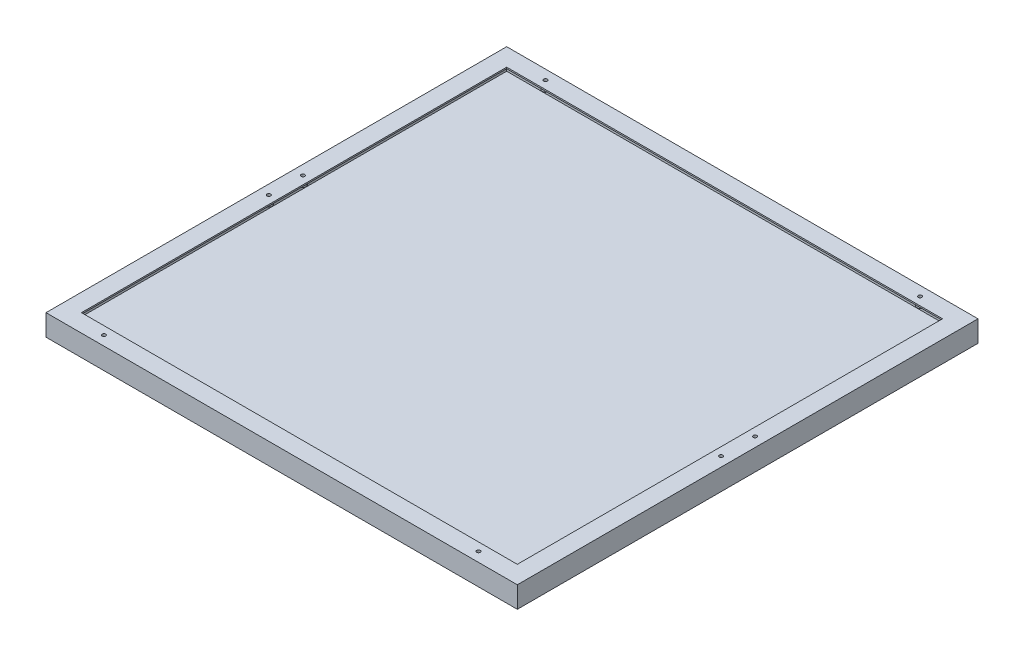
ISO-10303-21;
HEADER;
FILE_DESCRIPTION(('STEP AP214'),'2;1');
FILE_NAME('part.step','',(''),(''),'','','');
FILE_SCHEMA(('AUTOMOTIVE_DESIGN { 1 0 10303 214 1 1 1 1 }'));
ENDSEC;
DATA;
#1=APPLICATION_CONTEXT('core data for automotive mechanical design processes');
#2=APPLICATION_PROTOCOL_DEFINITION('international standard','automotive_design',2000,#1);
#3=PRODUCT_CONTEXT('',#1,'mechanical');
#4=PRODUCT('Part','Part','',(#3));
#5=PRODUCT_RELATED_PRODUCT_CATEGORY('part','',(#4));
#6=PRODUCT_DEFINITION_FORMATION('','',#4);
#7=PRODUCT_DEFINITION_CONTEXT('part definition',#1,'design');
#8=PRODUCT_DEFINITION('design','',#6,#7);
#9=PRODUCT_DEFINITION_SHAPE('','',#8);
#10=(LENGTH_UNIT() NAMED_UNIT(*) SI_UNIT(.MILLI.,.METRE.));
#11=(NAMED_UNIT(*) PLANE_ANGLE_UNIT() SI_UNIT($,.RADIAN.));
#12=(NAMED_UNIT(*) SI_UNIT($,.STERADIAN.) SOLID_ANGLE_UNIT());
#13=UNCERTAINTY_MEASURE_WITH_UNIT(LENGTH_MEASURE(1.E-05),#10,'distance_accuracy_value','');
#14=(GEOMETRIC_REPRESENTATION_CONTEXT(3) GLOBAL_UNCERTAINTY_ASSIGNED_CONTEXT((#13)) GLOBAL_UNIT_ASSIGNED_CONTEXT((#10,
#11,#12)) REPRESENTATION_CONTEXT('',''));
#15=CARTESIAN_POINT('',(0.,0.,0.));
#16=DIRECTION('',(0.,0.,1.));
#17=DIRECTION('',(1.,0.,0.));
#18=AXIS2_PLACEMENT_3D('',#15,#16,#17);
#19=CARTESIAN_POINT('',(25.,-20.,-625.));
#20=DIRECTION('',(-1.,0.,0.));
#21=DIRECTION('',(0.,0.,1.));
#22=AXIS2_PLACEMENT_3D('',#19,#20,#21);
#23=PLANE('',#22);
#24=DIRECTION('',(0.,0.,1.));
#25=VECTOR('',#24,1.);
#26=CARTESIAN_POINT('',(25.,-2.,-625.));
#27=LINE('',#26,#25);
#28=CARTESIAN_POINT('',(25.,-2.,-625.));
#29=VERTEX_POINT('',#28);
#30=CARTESIAN_POINT('',(25.0000000000001,-2.,-25.));
#31=VERTEX_POINT('',#30);
#32=EDGE_CURVE('E54',#29,#31,#27,.T.);
#33=ORIENTED_EDGE('',*,*,#32,.F.);
#34=DIRECTION('',(0.,1.,0.));
#35=VECTOR('',#34,1.);
#36=CARTESIAN_POINT('',(25.,-20.,-625.));
#37=LINE('',#36,#35);
#38=CARTESIAN_POINT('',(25.,0.,-625.));
#39=VERTEX_POINT('',#38);
#40=EDGE_CURVE('E234',#29,#39,#37,.T.);
#41=ORIENTED_EDGE('',*,*,#40,.T.);
#42=DIRECTION('',(0.,0.,1.));
#43=VECTOR('',#42,1.);
#44=CARTESIAN_POINT('',(25.,0.,-625.));
#45=LINE('',#44,#43);
#46=CARTESIAN_POINT('',(25.0000000000001,0.,-25.));
#47=VERTEX_POINT('',#46);
#48=EDGE_CURVE('E138',#39,#47,#45,.T.);
#49=ORIENTED_EDGE('',*,*,#48,.T.);
#50=DIRECTION('',(0.,1.,0.));
#51=VECTOR('',#50,1.);
#52=CARTESIAN_POINT('',(25.0000000000001,-20.,-25.));
#53=LINE('',#52,#51);
#54=EDGE_CURVE('E61',#31,#47,#53,.T.);
#55=ORIENTED_EDGE('',*,*,#54,.F.);
#56=EDGE_LOOP('',(#33,#41,#49,#55));
#57=FACE_BOUND('',#56,.T.);
#58=ADVANCED_FACE('F37',(#57),#23,.F.);
#59=CARTESIAN_POINT('',(25.,-20.,-625.));
#60=DIRECTION('',(0.,0.,-1.));
#61=DIRECTION('',(-1.,0.,0.));
#62=AXIS2_PLACEMENT_3D('',#59,#60,#61);
#63=PLANE('',#62);
#64=DIRECTION('',(-1.,0.,0.));
#65=VECTOR('',#64,1.);
#66=CARTESIAN_POINT('',(25.,-2.,-625.));
#67=LINE('',#66,#65);
#68=CARTESIAN_POINT('',(640.,-2.,-625.));
#69=VERTEX_POINT('',#68);
#70=EDGE_CURVE('E174',#69,#29,#67,.T.);
#71=ORIENTED_EDGE('',*,*,#70,.F.);
#72=DIRECTION('',(0.,1.,0.));
#73=VECTOR('',#72,1.);
#74=CARTESIAN_POINT('',(640.,-20.,-625.));
#75=LINE('',#74,#73);
#76=CARTESIAN_POINT('',(640.,0.,-625.));
#77=VERTEX_POINT('',#76);
#78=EDGE_CURVE('E237',#69,#77,#75,.T.);
#79=ORIENTED_EDGE('',*,*,#78,.T.);
#80=DIRECTION('',(-1.,0.,0.));
#81=VECTOR('',#80,1.);
#82=CARTESIAN_POINT('',(25.,0.,-625.));
#83=LINE('',#82,#81);
#84=EDGE_CURVE('E231',#77,#39,#83,.T.);
#85=ORIENTED_EDGE('',*,*,#84,.T.);
#86=ORIENTED_EDGE('',*,*,#40,.F.);
#87=EDGE_LOOP('',(#71,#79,#85,#86));
#88=FACE_BOUND('',#87,.T.);
#89=ADVANCED_FACE('F341',(#88),#63,.F.);
#90=CARTESIAN_POINT('',(640.,-20.,-625.));
#91=DIRECTION('',(1.,0.,0.));
#92=DIRECTION('',(0.,0.,-1.));
#93=AXIS2_PLACEMENT_3D('',#90,#91,#92);
#94=PLANE('',#93);
#95=DIRECTION('',(0.,0.,-1.));
#96=VECTOR('',#95,1.);
#97=CARTESIAN_POINT('',(640.,-2.,-625.));
#98=LINE('',#97,#96);
#99=CARTESIAN_POINT('',(640.,-2.,-25.));
#100=VERTEX_POINT('',#99);
#101=EDGE_CURVE('E221',#100,#69,#98,.T.);
#102=ORIENTED_EDGE('',*,*,#101,.F.);
#103=DIRECTION('',(0.,1.,0.));
#104=VECTOR('',#103,1.);
#105=CARTESIAN_POINT('',(640.,-20.,-25.));
#106=LINE('',#105,#104);
#107=CARTESIAN_POINT('',(640.,0.,-25.));
#108=VERTEX_POINT('',#107);
#109=EDGE_CURVE('E239',#100,#108,#106,.T.);
#110=ORIENTED_EDGE('',*,*,#109,.T.);
#111=DIRECTION('',(0.,0.,-1.));
#112=VECTOR('',#111,1.);
#113=CARTESIAN_POINT('',(640.,0.,-625.));
#114=LINE('',#113,#112);
#115=EDGE_CURVE('E228',#108,#77,#114,.T.);
#116=ORIENTED_EDGE('',*,*,#115,.T.);
#117=ORIENTED_EDGE('',*,*,#78,.F.);
#118=EDGE_LOOP('',(#102,#110,#116,#117));
#119=FACE_BOUND('',#118,.T.);
#120=ADVANCED_FACE('F347',(#119),#94,.F.);
#121=CARTESIAN_POINT('',(25.0000000000001,-20.,-25.));
#122=DIRECTION('',(0.,0.,1.));
#123=DIRECTION('',(1.,0.,0.));
#124=AXIS2_PLACEMENT_3D('',#121,#122,#123);
#125=PLANE('',#124);
#126=DIRECTION('',(1.,0.,0.));
#127=VECTOR('',#126,1.);
#128=CARTESIAN_POINT('',(25.0000000000001,-2.,-25.));
#129=LINE('',#128,#127);
#130=EDGE_CURVE('E219',#31,#100,#129,.T.);
#131=ORIENTED_EDGE('',*,*,#130,.F.);
#132=ORIENTED_EDGE('',*,*,#54,.T.);
#133=DIRECTION('',(1.,0.,0.));
#134=VECTOR('',#133,1.);
#135=CARTESIAN_POINT('',(25.0000000000001,0.,-25.));
#136=LINE('',#135,#134);
#137=EDGE_CURVE('E226',#47,#108,#136,.T.);
#138=ORIENTED_EDGE('',*,*,#137,.T.);
#139=ORIENTED_EDGE('',*,*,#109,.F.);
#140=EDGE_LOOP('',(#131,#132,#138,#139));
#141=FACE_BOUND('',#140,.T.);
#142=ADVANCED_FACE('F352',(#141),#125,.F.);
#143=CARTESIAN_POINT('',(0.,-30.,0.));
#144=DIRECTION('',(-1.,0.,0.));
#145=DIRECTION('',(0.,0.,1.));
#146=AXIS2_PLACEMENT_3D('',#143,#144,#145);
#147=PLANE('',#146);
#148=DIRECTION('',(0.,0.,1.));
#149=VECTOR('',#148,1.);
#150=CARTESIAN_POINT('',(0.,0.,0.));
#151=LINE('',#150,#149);
#152=CARTESIAN_POINT('',(0.,0.,-650.));
#153=VERTEX_POINT('',#152);
#154=CARTESIAN_POINT('',(0.,0.,0.));
#155=VERTEX_POINT('',#154);
#156=EDGE_CURVE('E289',#153,#155,#151,.T.);
#157=ORIENTED_EDGE('',*,*,#156,.F.);
#158=DIRECTION('',(0.,1.,0.));
#159=VECTOR('',#158,1.);
#160=CARTESIAN_POINT('',(0.,-30.,-650.));
#161=LINE('',#160,#159);
#162=CARTESIAN_POINT('',(0.,-30.,-650.));
#163=VERTEX_POINT('',#162);
#164=EDGE_CURVE('E11',#163,#153,#161,.T.);
#165=ORIENTED_EDGE('',*,*,#164,.F.);
#166=DIRECTION('',(0.,0.,1.));
#167=VECTOR('',#166,1.);
#168=CARTESIAN_POINT('',(0.,-30.,0.));
#169=LINE('',#168,#167);
#170=CARTESIAN_POINT('',(0.,-30.,0.));
#171=VERTEX_POINT('',#170);
#172=EDGE_CURVE('E290',#163,#171,#169,.T.);
#173=ORIENTED_EDGE('',*,*,#172,.T.);
#174=DIRECTION('',(0.,1.,0.));
#175=VECTOR('',#174,1.);
#176=CARTESIAN_POINT('',(0.,-30.,0.));
#177=LINE('',#176,#175);
#178=EDGE_CURVE('E41',#171,#155,#177,.T.);
#179=ORIENTED_EDGE('',*,*,#178,.T.);
#180=EDGE_LOOP('',(#157,#165,#173,#179));
#181=FACE_BOUND('',#180,.T.);
#182=ADVANCED_FACE('F39',(#181),#147,.T.);
#183=CARTESIAN_POINT('',(0.,-30.,-650.));
#184=DIRECTION('',(0.,0.,-1.));
#185=DIRECTION('',(-1.,0.,0.));
#186=AXIS2_PLACEMENT_3D('',#183,#184,#185);
#187=PLANE('',#186);
#188=DIRECTION('',(-1.,0.,0.));
#189=VECTOR('',#188,1.);
#190=CARTESIAN_POINT('',(0.,0.,-650.));
#191=LINE('',#190,#189);
#192=CARTESIAN_POINT('',(665.,0.,-650.));
#193=VERTEX_POINT('',#192);
#194=EDGE_CURVE('E294',#193,#153,#191,.T.);
#195=ORIENTED_EDGE('',*,*,#194,.F.);
#196=DIRECTION('',(0.,1.,0.));
#197=VECTOR('',#196,1.);
#198=CARTESIAN_POINT('',(665.,-30.,-650.));
#199=LINE('',#198,#197);
#200=CARTESIAN_POINT('',(665.,-30.,-650.));
#201=VERTEX_POINT('',#200);
#202=EDGE_CURVE('E46',#201,#193,#199,.T.);
#203=ORIENTED_EDGE('',*,*,#202,.F.);
#204=DIRECTION('',(-1.,0.,0.));
#205=VECTOR('',#204,1.);
#206=CARTESIAN_POINT('',(0.,-30.,-650.));
#207=LINE('',#206,#205);
#208=EDGE_CURVE('E300',#201,#163,#207,.T.);
#209=ORIENTED_EDGE('',*,*,#208,.T.);
#210=ORIENTED_EDGE('',*,*,#164,.T.);
#211=EDGE_LOOP('',(#195,#203,#209,#210));
#212=FACE_BOUND('',#211,.T.);
#213=ADVANCED_FACE('F326',(#212),#187,.T.);
#214=CARTESIAN_POINT('',(665.,-30.,0.));
#215=DIRECTION('',(1.,0.,0.));
#216=DIRECTION('',(0.,0.,-1.));
#217=AXIS2_PLACEMENT_3D('',#214,#215,#216);
#218=PLANE('',#217);
#219=DIRECTION('',(0.,0.,-1.));
#220=VECTOR('',#219,1.);
#221=CARTESIAN_POINT('',(665.,0.,0.));
#222=LINE('',#221,#220);
#223=CARTESIAN_POINT('',(665.,0.,0.));
#224=VERTEX_POINT('',#223);
#225=EDGE_CURVE('E308',#224,#193,#222,.T.);
#226=ORIENTED_EDGE('',*,*,#225,.F.);
#227=DIRECTION('',(0.,1.,0.));
#228=VECTOR('',#227,1.);
#229=CARTESIAN_POINT('',(665.,-30.,0.));
#230=LINE('',#229,#228);
#231=CARTESIAN_POINT('',(665.,-30.,0.));
#232=VERTEX_POINT('',#231);
#233=EDGE_CURVE('E313',#232,#224,#230,.T.);
#234=ORIENTED_EDGE('',*,*,#233,.F.);
#235=DIRECTION('',(0.,0.,-1.));
#236=VECTOR('',#235,1.);
#237=CARTESIAN_POINT('',(665.,-30.,0.));
#238=LINE('',#237,#236);
#239=EDGE_CURVE('E297',#232,#201,#238,.T.);
#240=ORIENTED_EDGE('',*,*,#239,.T.);
#241=ORIENTED_EDGE('',*,*,#202,.T.);
#242=EDGE_LOOP('',(#226,#234,#240,#241));
#243=FACE_BOUND('',#242,.T.);
#244=ADVANCED_FACE('F332',(#243),#218,.T.);
#245=CARTESIAN_POINT('',(0.,-30.,0.));
#246=DIRECTION('',(0.,0.,1.));
#247=DIRECTION('',(1.,0.,0.));
#248=AXIS2_PLACEMENT_3D('',#245,#246,#247);
#249=PLANE('',#248);
#250=DIRECTION('',(1.,0.,0.));
#251=VECTOR('',#250,1.);
#252=CARTESIAN_POINT('',(0.,0.,0.));
#253=LINE('',#252,#251);
#254=EDGE_CURVE('E305',#155,#224,#253,.T.);
#255=ORIENTED_EDGE('',*,*,#254,.F.);
#256=ORIENTED_EDGE('',*,*,#178,.F.);
#257=DIRECTION('',(1.,0.,0.));
#258=VECTOR('',#257,1.);
#259=CARTESIAN_POINT('',(0.,-30.,0.));
#260=LINE('',#259,#258);
#261=EDGE_CURVE('E293',#171,#232,#260,.T.);
#262=ORIENTED_EDGE('',*,*,#261,.T.);
#263=ORIENTED_EDGE('',*,*,#233,.T.);
#264=EDGE_LOOP('',(#255,#256,#262,#263));
#265=FACE_BOUND('',#264,.T.);
#266=ADVANCED_FACE('F321',(#265),#249,.T.);
#267=CARTESIAN_POINT('',(0.,-30.,0.));
#268=DIRECTION('',(0.,-1.,0.));
#269=DIRECTION('',(0.,0.,-1.));
#270=AXIS2_PLACEMENT_3D('',#267,#268,#269);
#271=PLANE('',#270);
#272=ORIENTED_EDGE('',*,*,#172,.F.);
#273=ORIENTED_EDGE('',*,*,#208,.F.);
#274=ORIENTED_EDGE('',*,*,#239,.F.);
#275=ORIENTED_EDGE('',*,*,#261,.F.);
#276=EDGE_LOOP('',(#272,#273,#274,#275));
#277=FACE_BOUND('',#276,.T.);
#278=ADVANCED_FACE('F329',(#277),#271,.T.);
#279=CARTESIAN_POINT('',(0.,0.,0.));
#280=DIRECTION('',(0.,-1.,0.));
#281=DIRECTION('',(0.,0.,-1.));
#282=AXIS2_PLACEMENT_3D('',#279,#280,#281);
#283=PLANE('',#282);
#284=ORIENTED_EDGE('',*,*,#137,.F.);
#285=ORIENTED_EDGE('',*,*,#48,.F.);
#286=ORIENTED_EDGE('',*,*,#84,.F.);
#287=ORIENTED_EDGE('',*,*,#115,.F.);
#288=EDGE_LOOP('',(#284,#285,#286,#287));
#289=FACE_BOUND('',#288,.T.);
#290=CARTESIAN_POINT('',(68.25,0.,-13.5));
#291=DIRECTION('',(0.,1.,0.));
#292=DIRECTION('',(0.,0.,1.));
#293=AXIS2_PLACEMENT_3D('',#290,#291,#292);
#294=CIRCLE('',#293,2.5273);
#295=CARTESIAN_POINT('',(68.25,0.,-10.9727));
#296=VERTEX_POINT('',#295);
#297=EDGE_CURVE('E236',#296,#296,#294,.T.);
#298=ORIENTED_EDGE('',*,*,#297,.F.);
#299=EDGE_LOOP('',(#298));
#300=FACE_BOUND('',#299,.T.);
#301=CARTESIAN_POINT('',(13.5,0.,-301.));
#302=DIRECTION('',(0.,1.,0.));
#303=DIRECTION('',(0.,0.,1.));
#304=AXIS2_PLACEMENT_3D('',#301,#302,#303);
#305=CIRCLE('',#304,2.5273);
#306=CARTESIAN_POINT('',(13.5,0.,-298.4727));
#307=VERTEX_POINT('',#306);
#308=EDGE_CURVE('E247',#307,#307,#305,.T.);
#309=ORIENTED_EDGE('',*,*,#308,.F.);
#310=EDGE_LOOP('',(#309));
#311=FACE_BOUND('',#310,.T.);
#312=CARTESIAN_POINT('',(596.75,0.,-13.5));
#313=DIRECTION('',(0.,1.,0.));
#314=DIRECTION('',(0.,0.,1.));
#315=AXIS2_PLACEMENT_3D('',#312,#313,#314);
#316=CIRCLE('',#315,2.52730000000001);
#317=CARTESIAN_POINT('',(596.75,0.,-10.9726999999999));
#318=VERTEX_POINT('',#317);
#319=EDGE_CURVE('E253',#318,#318,#316,.T.);
#320=ORIENTED_EDGE('',*,*,#319,.F.);
#321=EDGE_LOOP('',(#320));
#322=FACE_BOUND('',#321,.T.);
#323=CARTESIAN_POINT('',(651.5,0.,-301.));
#324=DIRECTION('',(0.,1.,0.));
#325=DIRECTION('',(0.,0.,1.));
#326=AXIS2_PLACEMENT_3D('',#323,#324,#325);
#327=CIRCLE('',#326,2.52730000000001);
#328=CARTESIAN_POINT('',(651.5,0.,-298.4727));
#329=VERTEX_POINT('',#328);
#330=EDGE_CURVE('E259',#329,#329,#327,.T.);
#331=ORIENTED_EDGE('',*,*,#330,.F.);
#332=EDGE_LOOP('',(#331));
#333=FACE_BOUND('',#332,.T.);
#334=CARTESIAN_POINT('',(651.5,0.,-349.));
#335=DIRECTION('',(0.,1.,0.));
#336=DIRECTION('',(0.,0.,1.));
#337=AXIS2_PLACEMENT_3D('',#334,#335,#336);
#338=CIRCLE('',#337,2.52730000000001);
#339=CARTESIAN_POINT('',(651.5,0.,-346.4727));
#340=VERTEX_POINT('',#339);
#341=EDGE_CURVE('E265',#340,#340,#338,.T.);
#342=ORIENTED_EDGE('',*,*,#341,.F.);
#343=EDGE_LOOP('',(#342));
#344=FACE_BOUND('',#343,.T.);
#345=CARTESIAN_POINT('',(596.75,0.,-636.5));
#346=DIRECTION('',(0.,1.,0.));
#347=DIRECTION('',(0.,0.,1.));
#348=AXIS2_PLACEMENT_3D('',#345,#346,#347);
#349=CIRCLE('',#348,2.52730000000001);
#350=CARTESIAN_POINT('',(596.75,0.,-633.9727));
#351=VERTEX_POINT('',#350);
#352=EDGE_CURVE('E271',#351,#351,#349,.T.);
#353=ORIENTED_EDGE('',*,*,#352,.F.);
#354=EDGE_LOOP('',(#353));
#355=FACE_BOUND('',#354,.T.);
#356=CARTESIAN_POINT('',(68.25,0.,-636.5));
#357=DIRECTION('',(0.,1.,0.));
#358=DIRECTION('',(0.,0.,1.));
#359=AXIS2_PLACEMENT_3D('',#356,#357,#358);
#360=CIRCLE('',#359,2.5273);
#361=CARTESIAN_POINT('',(68.25,0.,-633.9727));
#362=VERTEX_POINT('',#361);
#363=EDGE_CURVE('E277',#362,#362,#360,.T.);
#364=ORIENTED_EDGE('',*,*,#363,.F.);
#365=EDGE_LOOP('',(#364));
#366=FACE_BOUND('',#365,.T.);
#367=CARTESIAN_POINT('',(13.5000000000001,0.,-349.));
#368=DIRECTION('',(0.,1.,0.));
#369=DIRECTION('',(0.,0.,1.));
#370=AXIS2_PLACEMENT_3D('',#367,#368,#369);
#371=CIRCLE('',#370,2.5273);
#372=CARTESIAN_POINT('',(13.5000000000001,0.,-346.4727));
#373=VERTEX_POINT('',#372);
#374=EDGE_CURVE('E283',#373,#373,#371,.T.);
#375=ORIENTED_EDGE('',*,*,#374,.F.);
#376=EDGE_LOOP('',(#375));
#377=FACE_BOUND('',#376,.T.);
#378=ORIENTED_EDGE('',*,*,#156,.T.);
#379=ORIENTED_EDGE('',*,*,#254,.T.);
#380=ORIENTED_EDGE('',*,*,#225,.T.);
#381=ORIENTED_EDGE('',*,*,#194,.T.);
#382=EDGE_LOOP('',(#378,#379,#380,#381));
#383=FACE_BOUND('',#382,.T.);
#384=ADVANCED_FACE('F323',(#289,#300,#311,#322,#333,#344,#355,#366,#377,#383),#283,.F.);
#385=CARTESIAN_POINT('',(13.5000000000001,-9.65,-349.));
#386=DIRECTION('',(0.,-1.,0.));
#387=DIRECTION('',(0.,0.,-1.));
#388=AXIS2_PLACEMENT_3D('',#385,#386,#387);
#389=PLANE('',#388);
#390=CARTESIAN_POINT('',(13.5000000000001,-9.65,-349.));
#391=DIRECTION('',(0.,1.,0.));
#392=DIRECTION('',(0.,0.,1.));
#393=AXIS2_PLACEMENT_3D('',#390,#391,#392);
#394=CIRCLE('',#393,2.5273);
#395=CARTESIAN_POINT('',(13.5000000000001,-9.65,-346.4727));
#396=VERTEX_POINT('',#395);
#397=EDGE_CURVE('E286',#396,#396,#394,.T.);
#398=ORIENTED_EDGE('',*,*,#397,.T.);
#399=EDGE_LOOP('',(#398));
#400=FACE_BOUND('',#399,.T.);
#401=ADVANCED_FACE('F413',(#400),#389,.F.);
#402=CARTESIAN_POINT('',(13.5000000000001,0.,-349.));
#403=DIRECTION('',(0.,1.,0.));
#404=DIRECTION('',(0.,0.,1.));
#405=AXIS2_PLACEMENT_3D('',#402,#403,#404);
#406=CYLINDRICAL_SURFACE('',#405,2.5273);
#407=ORIENTED_EDGE('',*,*,#397,.F.);
#408=EDGE_LOOP('',(#407));
#409=FACE_BOUND('',#408,.T.);
#410=ORIENTED_EDGE('',*,*,#374,.T.);
#411=EDGE_LOOP('',(#410));
#412=FACE_BOUND('',#411,.T.);
#413=ADVANCED_FACE('F409',(#409,#412),#406,.F.);
#414=CARTESIAN_POINT('',(68.25,-9.65,-636.5));
#415=DIRECTION('',(0.,-1.,0.));
#416=DIRECTION('',(0.,0.,-1.));
#417=AXIS2_PLACEMENT_3D('',#414,#415,#416);
#418=PLANE('',#417);
#419=CARTESIAN_POINT('',(68.25,-9.65,-636.5));
#420=DIRECTION('',(0.,1.,0.));
#421=DIRECTION('',(0.,0.,1.));
#422=AXIS2_PLACEMENT_3D('',#419,#420,#421);
#423=CIRCLE('',#422,2.5273);
#424=CARTESIAN_POINT('',(68.25,-9.65,-633.9727));
#425=VERTEX_POINT('',#424);
#426=EDGE_CURVE('E280',#425,#425,#423,.T.);
#427=ORIENTED_EDGE('',*,*,#426,.T.);
#428=EDGE_LOOP('',(#427));
#429=FACE_BOUND('',#428,.T.);
#430=ADVANCED_FACE('F405',(#429),#418,.F.);
#431=CARTESIAN_POINT('',(68.25,0.,-636.5));
#432=DIRECTION('',(0.,1.,0.));
#433=DIRECTION('',(0.,0.,1.));
#434=AXIS2_PLACEMENT_3D('',#431,#432,#433);
#435=CYLINDRICAL_SURFACE('',#434,2.5273);
#436=ORIENTED_EDGE('',*,*,#426,.F.);
#437=EDGE_LOOP('',(#436));
#438=FACE_BOUND('',#437,.T.);
#439=ORIENTED_EDGE('',*,*,#363,.T.);
#440=EDGE_LOOP('',(#439));
#441=FACE_BOUND('',#440,.T.);
#442=ADVANCED_FACE('F401',(#438,#441),#435,.F.);
#443=CARTESIAN_POINT('',(596.75,-9.65,-636.5));
#444=DIRECTION('',(0.,-1.,0.));
#445=DIRECTION('',(0.,0.,-1.));
#446=AXIS2_PLACEMENT_3D('',#443,#444,#445);
#447=PLANE('',#446);
#448=CARTESIAN_POINT('',(596.75,-9.65,-636.5));
#449=DIRECTION('',(0.,1.,0.));
#450=DIRECTION('',(0.,0.,1.));
#451=AXIS2_PLACEMENT_3D('',#448,#449,#450);
#452=CIRCLE('',#451,2.52730000000001);
#453=CARTESIAN_POINT('',(596.75,-9.65,-633.9727));
#454=VERTEX_POINT('',#453);
#455=EDGE_CURVE('E274',#454,#454,#452,.T.);
#456=ORIENTED_EDGE('',*,*,#455,.T.);
#457=EDGE_LOOP('',(#456));
#458=FACE_BOUND('',#457,.T.);
#459=ADVANCED_FACE('F397',(#458),#447,.F.);
#460=CARTESIAN_POINT('',(596.75,0.,-636.5));
#461=DIRECTION('',(0.,1.,0.));
#462=DIRECTION('',(0.,0.,1.));
#463=AXIS2_PLACEMENT_3D('',#460,#461,#462);
#464=CYLINDRICAL_SURFACE('',#463,2.52730000000001);
#465=ORIENTED_EDGE('',*,*,#455,.F.);
#466=EDGE_LOOP('',(#465));
#467=FACE_BOUND('',#466,.T.);
#468=ORIENTED_EDGE('',*,*,#352,.T.);
#469=EDGE_LOOP('',(#468));
#470=FACE_BOUND('',#469,.T.);
#471=ADVANCED_FACE('F393',(#467,#470),#464,.F.);
#472=CARTESIAN_POINT('',(651.5,-9.65,-349.));
#473=DIRECTION('',(0.,-1.,0.));
#474=DIRECTION('',(0.,0.,-1.));
#475=AXIS2_PLACEMENT_3D('',#472,#473,#474);
#476=PLANE('',#475);
#477=CARTESIAN_POINT('',(651.5,-9.65,-349.));
#478=DIRECTION('',(0.,1.,0.));
#479=DIRECTION('',(0.,0.,1.));
#480=AXIS2_PLACEMENT_3D('',#477,#478,#479);
#481=CIRCLE('',#480,2.52730000000001);
#482=CARTESIAN_POINT('',(651.5,-9.65,-346.4727));
#483=VERTEX_POINT('',#482);
#484=EDGE_CURVE('E268',#483,#483,#481,.T.);
#485=ORIENTED_EDGE('',*,*,#484,.T.);
#486=EDGE_LOOP('',(#485));
#487=FACE_BOUND('',#486,.T.);
#488=ADVANCED_FACE('F389',(#487),#476,.F.);
#489=CARTESIAN_POINT('',(651.5,0.,-349.));
#490=DIRECTION('',(0.,1.,0.));
#491=DIRECTION('',(0.,0.,1.));
#492=AXIS2_PLACEMENT_3D('',#489,#490,#491);
#493=CYLINDRICAL_SURFACE('',#492,2.52730000000001);
#494=ORIENTED_EDGE('',*,*,#484,.F.);
#495=EDGE_LOOP('',(#494));
#496=FACE_BOUND('',#495,.T.);
#497=ORIENTED_EDGE('',*,*,#341,.T.);
#498=EDGE_LOOP('',(#497));
#499=FACE_BOUND('',#498,.T.);
#500=ADVANCED_FACE('F385',(#496,#499),#493,.F.);
#501=CARTESIAN_POINT('',(651.5,-9.65,-301.));
#502=DIRECTION('',(0.,-1.,0.));
#503=DIRECTION('',(0.,0.,-1.));
#504=AXIS2_PLACEMENT_3D('',#501,#502,#503);
#505=PLANE('',#504);
#506=CARTESIAN_POINT('',(651.5,-9.65,-301.));
#507=DIRECTION('',(0.,1.,0.));
#508=DIRECTION('',(0.,0.,1.));
#509=AXIS2_PLACEMENT_3D('',#506,#507,#508);
#510=CIRCLE('',#509,2.52730000000001);
#511=CARTESIAN_POINT('',(651.5,-9.65,-298.4727));
#512=VERTEX_POINT('',#511);
#513=EDGE_CURVE('E262',#512,#512,#510,.T.);
#514=ORIENTED_EDGE('',*,*,#513,.T.);
#515=EDGE_LOOP('',(#514));
#516=FACE_BOUND('',#515,.T.);
#517=ADVANCED_FACE('F381',(#516),#505,.F.);
#518=CARTESIAN_POINT('',(651.5,0.,-301.));
#519=DIRECTION('',(0.,1.,0.));
#520=DIRECTION('',(0.,0.,1.));
#521=AXIS2_PLACEMENT_3D('',#518,#519,#520);
#522=CYLINDRICAL_SURFACE('',#521,2.52730000000001);
#523=ORIENTED_EDGE('',*,*,#513,.F.);
#524=EDGE_LOOP('',(#523));
#525=FACE_BOUND('',#524,.T.);
#526=ORIENTED_EDGE('',*,*,#330,.T.);
#527=EDGE_LOOP('',(#526));
#528=FACE_BOUND('',#527,.T.);
#529=ADVANCED_FACE('F377',(#525,#528),#522,.F.);
#530=CARTESIAN_POINT('',(596.75,-9.65,-13.5));
#531=DIRECTION('',(0.,-1.,0.));
#532=DIRECTION('',(0.,0.,-1.));
#533=AXIS2_PLACEMENT_3D('',#530,#531,#532);
#534=PLANE('',#533);
#535=CARTESIAN_POINT('',(596.75,-9.65,-13.5));
#536=DIRECTION('',(0.,1.,0.));
#537=DIRECTION('',(0.,0.,1.));
#538=AXIS2_PLACEMENT_3D('',#535,#536,#537);
#539=CIRCLE('',#538,2.52730000000001);
#540=CARTESIAN_POINT('',(596.75,-9.65,-10.9726999999999));
#541=VERTEX_POINT('',#540);
#542=EDGE_CURVE('E256',#541,#541,#539,.T.);
#543=ORIENTED_EDGE('',*,*,#542,.T.);
#544=EDGE_LOOP('',(#543));
#545=FACE_BOUND('',#544,.T.);
#546=ADVANCED_FACE('F373',(#545),#534,.F.);
#547=CARTESIAN_POINT('',(596.75,0.,-13.5));
#548=DIRECTION('',(0.,1.,0.));
#549=DIRECTION('',(0.,0.,1.));
#550=AXIS2_PLACEMENT_3D('',#547,#548,#549);
#551=CYLINDRICAL_SURFACE('',#550,2.52730000000001);
#552=ORIENTED_EDGE('',*,*,#542,.F.);
#553=EDGE_LOOP('',(#552));
#554=FACE_BOUND('',#553,.T.);
#555=ORIENTED_EDGE('',*,*,#319,.T.);
#556=EDGE_LOOP('',(#555));
#557=FACE_BOUND('',#556,.T.);
#558=ADVANCED_FACE('F369',(#554,#557),#551,.F.);
#559=CARTESIAN_POINT('',(13.5,-9.65,-301.));
#560=DIRECTION('',(0.,-1.,0.));
#561=DIRECTION('',(0.,0.,-1.));
#562=AXIS2_PLACEMENT_3D('',#559,#560,#561);
#563=PLANE('',#562);
#564=CARTESIAN_POINT('',(13.5,-9.65,-301.));
#565=DIRECTION('',(0.,1.,0.));
#566=DIRECTION('',(0.,0.,1.));
#567=AXIS2_PLACEMENT_3D('',#564,#565,#566);
#568=CIRCLE('',#567,2.5273);
#569=CARTESIAN_POINT('',(13.5,-9.65,-298.4727));
#570=VERTEX_POINT('',#569);
#571=EDGE_CURVE('E250',#570,#570,#568,.T.);
#572=ORIENTED_EDGE('',*,*,#571,.T.);
#573=EDGE_LOOP('',(#572));
#574=FACE_BOUND('',#573,.T.);
#575=ADVANCED_FACE('F365',(#574),#563,.F.);
#576=CARTESIAN_POINT('',(13.5,0.,-301.));
#577=DIRECTION('',(0.,1.,0.));
#578=DIRECTION('',(0.,0.,1.));
#579=AXIS2_PLACEMENT_3D('',#576,#577,#578);
#580=CYLINDRICAL_SURFACE('',#579,2.5273);
#581=ORIENTED_EDGE('',*,*,#571,.F.);
#582=EDGE_LOOP('',(#581));
#583=FACE_BOUND('',#582,.T.);
#584=ORIENTED_EDGE('',*,*,#308,.T.);
#585=EDGE_LOOP('',(#584));
#586=FACE_BOUND('',#585,.T.);
#587=ADVANCED_FACE('F361',(#583,#586),#580,.F.);
#588=CARTESIAN_POINT('',(68.25,-9.65,-13.5));
#589=DIRECTION('',(0.,-1.,0.));
#590=DIRECTION('',(0.,0.,-1.));
#591=AXIS2_PLACEMENT_3D('',#588,#589,#590);
#592=PLANE('',#591);
#593=CARTESIAN_POINT('',(68.25,-9.65,-13.5));
#594=DIRECTION('',(0.,1.,0.));
#595=DIRECTION('',(0.,0.,1.));
#596=AXIS2_PLACEMENT_3D('',#593,#594,#595);
#597=CIRCLE('',#596,2.5273);
#598=CARTESIAN_POINT('',(68.25,-9.65,-10.9727));
#599=VERTEX_POINT('',#598);
#600=EDGE_CURVE('E244',#599,#599,#597,.T.);
#601=ORIENTED_EDGE('',*,*,#600,.T.);
#602=EDGE_LOOP('',(#601));
#603=FACE_BOUND('',#602,.T.);
#604=ADVANCED_FACE('F357',(#603),#592,.F.);
#605=CARTESIAN_POINT('',(68.25,0.,-13.5));
#606=DIRECTION('',(0.,1.,0.));
#607=DIRECTION('',(0.,0.,1.));
#608=AXIS2_PLACEMENT_3D('',#605,#606,#607);
#609=CYLINDRICAL_SURFACE('',#608,2.5273);
#610=ORIENTED_EDGE('',*,*,#600,.F.);
#611=EDGE_LOOP('',(#610));
#612=FACE_BOUND('',#611,.T.);
#613=ORIENTED_EDGE('',*,*,#297,.T.);
#614=EDGE_LOOP('',(#613));
#615=FACE_BOUND('',#614,.T.);
#616=ADVANCED_FACE('F354',(#612,#615),#609,.F.);
#617=CARTESIAN_POINT('',(2.,-30.,0.));
#618=DIRECTION('',(-1.,0.,0.));
#619=DIRECTION('',(0.,0.,1.));
#620=AXIS2_PLACEMENT_3D('',#617,#618,#619);
#621=PLANE('',#620);
#622=DIRECTION('',(0.,0.,1.));
#623=VECTOR('',#622,1.);
#624=CARTESIAN_POINT('',(2.,-2.,0.));
#625=LINE('',#624,#623);
#626=CARTESIAN_POINT('',(2.,-2.,-648.));
#627=VERTEX_POINT('',#626);
#628=CARTESIAN_POINT('',(2.,-2.,-2.));
#629=VERTEX_POINT('',#628);
#630=EDGE_CURVE('E168',#627,#629,#625,.T.);
#631=ORIENTED_EDGE('',*,*,#630,.T.);
#632=DIRECTION('',(0.,1.,0.));
#633=VECTOR('',#632,1.);
#634=CARTESIAN_POINT('',(2.,-30.,-2.));
#635=LINE('',#634,#633);
#636=CARTESIAN_POINT('',(2.,-28.,-2.));
#637=VERTEX_POINT('',#636);
#638=EDGE_CURVE('E144',#637,#629,#635,.T.);
#639=ORIENTED_EDGE('',*,*,#638,.F.);
#640=DIRECTION('',(0.,0.,1.));
#641=VECTOR('',#640,1.);
#642=CARTESIAN_POINT('',(2.,-28.,0.));
#643=LINE('',#642,#641);
#644=CARTESIAN_POINT('',(2.,-28.,-648.));
#645=VERTEX_POINT('',#644);
#646=EDGE_CURVE('E142',#645,#637,#643,.T.);
#647=ORIENTED_EDGE('',*,*,#646,.F.);
#648=DIRECTION('',(0.,1.,0.));
#649=VECTOR('',#648,1.);
#650=CARTESIAN_POINT('',(2.,-30.,-648.));
#651=LINE('',#650,#649);
#652=EDGE_CURVE('E128',#645,#627,#651,.T.);
#653=ORIENTED_EDGE('',*,*,#652,.T.);
#654=EDGE_LOOP('',(#631,#639,#647,#653));
#655=FACE_BOUND('',#654,.T.);
#656=ADVANCED_FACE('F143',(#655),#621,.F.);
#657=CARTESIAN_POINT('',(0.,-30.,-648.));
#658=DIRECTION('',(0.,0.,-1.));
#659=DIRECTION('',(-1.,0.,0.));
#660=AXIS2_PLACEMENT_3D('',#657,#658,#659);
#661=PLANE('',#660);
#662=DIRECTION('',(-1.,0.,0.));
#663=VECTOR('',#662,1.);
#664=CARTESIAN_POINT('',(0.,-2.,-648.));
#665=LINE('',#664,#663);
#666=CARTESIAN_POINT('',(663.,-2.,-648.));
#667=VERTEX_POINT('',#666);
#668=EDGE_CURVE('E134',#667,#627,#665,.T.);
#669=ORIENTED_EDGE('',*,*,#668,.T.);
#670=ORIENTED_EDGE('',*,*,#652,.F.);
#671=DIRECTION('',(-1.,0.,0.));
#672=VECTOR('',#671,1.);
#673=CARTESIAN_POINT('',(0.,-28.,-648.));
#674=LINE('',#673,#672);
#675=CARTESIAN_POINT('',(663.,-28.,-648.));
#676=VERTEX_POINT('',#675);
#677=EDGE_CURVE('E132',#676,#645,#674,.T.);
#678=ORIENTED_EDGE('',*,*,#677,.F.);
#679=DIRECTION('',(0.,1.,0.));
#680=VECTOR('',#679,1.);
#681=CARTESIAN_POINT('',(663.,-30.,-648.));
#682=LINE('',#681,#680);
#683=EDGE_CURVE('E139',#676,#667,#682,.T.);
#684=ORIENTED_EDGE('',*,*,#683,.T.);
#685=EDGE_LOOP('',(#669,#670,#678,#684));
#686=FACE_BOUND('',#685,.T.);
#687=ADVANCED_FACE('F130',(#686),#661,.F.);
#688=CARTESIAN_POINT('',(663.,-30.,0.));
#689=DIRECTION('',(1.,0.,0.));
#690=DIRECTION('',(0.,0.,-1.));
#691=AXIS2_PLACEMENT_3D('',#688,#689,#690);
#692=PLANE('',#691);
#693=DIRECTION('',(0.,0.,-1.));
#694=VECTOR('',#693,1.);
#695=CARTESIAN_POINT('',(663.,-2.,0.));
#696=LINE('',#695,#694);
#697=CARTESIAN_POINT('',(663.,-2.,-2.));
#698=VERTEX_POINT('',#697);
#699=EDGE_CURVE('E161',#698,#667,#696,.T.);
#700=ORIENTED_EDGE('',*,*,#699,.T.);
#701=ORIENTED_EDGE('',*,*,#683,.F.);
#702=DIRECTION('',(0.,0.,-1.));
#703=VECTOR('',#702,1.);
#704=CARTESIAN_POINT('',(663.,-28.,0.));
#705=LINE('',#704,#703);
#706=CARTESIAN_POINT('',(663.,-28.,-2.));
#707=VERTEX_POINT('',#706);
#708=EDGE_CURVE('E153',#707,#676,#705,.T.);
#709=ORIENTED_EDGE('',*,*,#708,.F.);
#710=DIRECTION('',(0.,1.,0.));
#711=VECTOR('',#710,1.);
#712=CARTESIAN_POINT('',(663.,-30.,-2.));
#713=LINE('',#712,#711);
#714=EDGE_CURVE('E155',#707,#698,#713,.T.);
#715=ORIENTED_EDGE('',*,*,#714,.T.);
#716=EDGE_LOOP('',(#700,#701,#709,#715));
#717=FACE_BOUND('',#716,.T.);
#718=ADVANCED_FACE('F485',(#717),#692,.F.);
#719=CARTESIAN_POINT('',(0.,-30.,-2.));
#720=DIRECTION('',(0.,0.,1.));
#721=DIRECTION('',(1.,0.,0.));
#722=AXIS2_PLACEMENT_3D('',#719,#720,#721);
#723=PLANE('',#722);
#724=DIRECTION('',(1.,0.,0.));
#725=VECTOR('',#724,1.);
#726=CARTESIAN_POINT('',(0.,-2.,-2.));
#727=LINE('',#726,#725);
#728=EDGE_CURVE('E164',#629,#698,#727,.T.);
#729=ORIENTED_EDGE('',*,*,#728,.T.);
#730=ORIENTED_EDGE('',*,*,#714,.F.);
#731=DIRECTION('',(1.,0.,0.));
#732=VECTOR('',#731,1.);
#733=CARTESIAN_POINT('',(0.,-28.,-2.));
#734=LINE('',#733,#732);
#735=EDGE_CURVE('E148',#637,#707,#734,.T.);
#736=ORIENTED_EDGE('',*,*,#735,.F.);
#737=ORIENTED_EDGE('',*,*,#638,.T.);
#738=EDGE_LOOP('',(#729,#730,#736,#737));
#739=FACE_BOUND('',#738,.T.);
#740=ADVANCED_FACE('F483',(#739),#723,.F.);
#741=CARTESIAN_POINT('',(0.,-28.,0.));
#742=DIRECTION('',(0.,-1.,0.));
#743=DIRECTION('',(0.,0.,-1.));
#744=AXIS2_PLACEMENT_3D('',#741,#742,#743);
#745=PLANE('',#744);
#746=ORIENTED_EDGE('',*,*,#646,.T.);
#747=ORIENTED_EDGE('',*,*,#735,.T.);
#748=ORIENTED_EDGE('',*,*,#708,.T.);
#749=ORIENTED_EDGE('',*,*,#677,.T.);
#750=EDGE_LOOP('',(#746,#747,#748,#749));
#751=FACE_BOUND('',#750,.T.);
#752=ADVANCED_FACE('F151',(#751),#745,.F.);
#753=CARTESIAN_POINT('',(0.,-2.,0.));
#754=DIRECTION('',(0.,-1.,0.));
#755=DIRECTION('',(0.,0.,-1.));
#756=AXIS2_PLACEMENT_3D('',#753,#754,#755);
#757=PLANE('',#756);
#758=ORIENTED_EDGE('',*,*,#130,.T.);
#759=ORIENTED_EDGE('',*,*,#101,.T.);
#760=ORIENTED_EDGE('',*,*,#70,.T.);
#761=ORIENTED_EDGE('',*,*,#32,.T.);
#762=EDGE_LOOP('',(#758,#759,#760,#761));
#763=FACE_BOUND('',#762,.T.);
#764=CARTESIAN_POINT('',(68.25,-2.,-13.5));
#765=DIRECTION('',(0.,-1.,0.));
#766=DIRECTION('',(0.,0.,-1.));
#767=AXIS2_PLACEMENT_3D('',#764,#765,#766);
#768=CIRCLE('',#767,4.5273);
#769=CARTESIAN_POINT('',(68.25,-2.,-18.0273));
#770=VERTEX_POINT('',#769);
#771=EDGE_CURVE('E170',#770,#770,#768,.F.);
#772=ORIENTED_EDGE('',*,*,#771,.T.);
#773=EDGE_LOOP('',(#772));
#774=FACE_BOUND('',#773,.T.);
#775=CARTESIAN_POINT('',(13.5,-2.,-301.));
#776=DIRECTION('',(0.,-1.,0.));
#777=DIRECTION('',(0.,0.,-1.));
#778=AXIS2_PLACEMENT_3D('',#775,#776,#777);
#779=CIRCLE('',#778,4.5273);
#780=CARTESIAN_POINT('',(13.5,-2.,-305.5273));
#781=VERTEX_POINT('',#780);
#782=EDGE_CURVE('E175',#781,#781,#779,.F.);
#783=ORIENTED_EDGE('',*,*,#782,.T.);
#784=EDGE_LOOP('',(#783));
#785=FACE_BOUND('',#784,.T.);
#786=CARTESIAN_POINT('',(596.75,-2.,-13.5));
#787=DIRECTION('',(0.,-1.,0.));
#788=DIRECTION('',(0.,0.,-1.));
#789=AXIS2_PLACEMENT_3D('',#786,#787,#788);
#790=CIRCLE('',#789,4.52730000000001);
#791=CARTESIAN_POINT('',(596.75,-2.,-18.0273));
#792=VERTEX_POINT('',#791);
#793=EDGE_CURVE('E179',#792,#792,#790,.F.);
#794=ORIENTED_EDGE('',*,*,#793,.T.);
#795=EDGE_LOOP('',(#794));
#796=FACE_BOUND('',#795,.T.);
#797=CARTESIAN_POINT('',(651.5,-2.,-301.));
#798=DIRECTION('',(0.,-1.,0.));
#799=DIRECTION('',(0.,0.,-1.));
#800=AXIS2_PLACEMENT_3D('',#797,#798,#799);
#801=CIRCLE('',#800,4.52730000000001);
#802=CARTESIAN_POINT('',(651.5,-2.,-305.5273));
#803=VERTEX_POINT('',#802);
#804=EDGE_CURVE('E183',#803,#803,#801,.F.);
#805=ORIENTED_EDGE('',*,*,#804,.T.);
#806=EDGE_LOOP('',(#805));
#807=FACE_BOUND('',#806,.T.);
#808=CARTESIAN_POINT('',(651.5,-2.,-349.));
#809=DIRECTION('',(0.,-1.,0.));
#810=DIRECTION('',(0.,0.,-1.));
#811=AXIS2_PLACEMENT_3D('',#808,#809,#810);
#812=CIRCLE('',#811,4.52730000000001);
#813=CARTESIAN_POINT('',(651.5,-2.,-353.5273));
#814=VERTEX_POINT('',#813);
#815=EDGE_CURVE('E187',#814,#814,#812,.F.);
#816=ORIENTED_EDGE('',*,*,#815,.T.);
#817=EDGE_LOOP('',(#816));
#818=FACE_BOUND('',#817,.T.);
#819=CARTESIAN_POINT('',(596.75,-2.,-636.5));
#820=DIRECTION('',(0.,-1.,0.));
#821=DIRECTION('',(0.,0.,-1.));
#822=AXIS2_PLACEMENT_3D('',#819,#820,#821);
#823=CIRCLE('',#822,4.52730000000001);
#824=CARTESIAN_POINT('',(596.75,-2.,-641.0273));
#825=VERTEX_POINT('',#824);
#826=EDGE_CURVE('E191',#825,#825,#823,.F.);
#827=ORIENTED_EDGE('',*,*,#826,.T.);
#828=EDGE_LOOP('',(#827));
#829=FACE_BOUND('',#828,.T.);
#830=CARTESIAN_POINT('',(68.25,-2.,-636.5));
#831=DIRECTION('',(0.,-1.,0.));
#832=DIRECTION('',(0.,0.,-1.));
#833=AXIS2_PLACEMENT_3D('',#830,#831,#832);
#834=CIRCLE('',#833,4.5273);
#835=CARTESIAN_POINT('',(68.25,-2.,-641.0273));
#836=VERTEX_POINT('',#835);
#837=EDGE_CURVE('E195',#836,#836,#834,.F.);
#838=ORIENTED_EDGE('',*,*,#837,.T.);
#839=EDGE_LOOP('',(#838));
#840=FACE_BOUND('',#839,.T.);
#841=CARTESIAN_POINT('',(13.5000000000001,-2.,-349.));
#842=DIRECTION('',(0.,-1.,0.));
#843=DIRECTION('',(0.,0.,-1.));
#844=AXIS2_PLACEMENT_3D('',#841,#842,#843);
#845=CIRCLE('',#844,4.5273);
#846=CARTESIAN_POINT('',(13.5000000000001,-2.,-353.5273));
#847=VERTEX_POINT('',#846);
#848=EDGE_CURVE('E199',#847,#847,#845,.F.);
#849=ORIENTED_EDGE('',*,*,#848,.T.);
#850=EDGE_LOOP('',(#849));
#851=FACE_BOUND('',#850,.T.);
#852=ORIENTED_EDGE('',*,*,#630,.F.);
#853=ORIENTED_EDGE('',*,*,#668,.F.);
#854=ORIENTED_EDGE('',*,*,#699,.F.);
#855=ORIENTED_EDGE('',*,*,#728,.F.);
#856=EDGE_LOOP('',(#852,#853,#854,#855));
#857=FACE_BOUND('',#856,.T.);
#858=ADVANCED_FACE('F457',(#763,#774,#785,#796,#807,#818,#829,#840,#851,#857),#757,.T.);
#859=CARTESIAN_POINT('',(13.5000000000001,-11.65,-349.));
#860=DIRECTION('',(0.,-1.,0.));
#861=DIRECTION('',(0.,0.,-1.));
#862=AXIS2_PLACEMENT_3D('',#859,#860,#861);
#863=PLANE('',#862);
#864=CARTESIAN_POINT('',(13.5000000000001,-11.65,-349.));
#865=DIRECTION('',(0.,-1.,0.));
#866=DIRECTION('',(0.,0.,-1.));
#867=AXIS2_PLACEMENT_3D('',#864,#865,#866);
#868=CIRCLE('',#867,4.5273);
#869=CARTESIAN_POINT('',(13.5000000000001,-11.65,-353.5273));
#870=VERTEX_POINT('',#869);
#871=EDGE_CURVE('E202',#870,#870,#868,.F.);
#872=ORIENTED_EDGE('',*,*,#871,.F.);
#873=EDGE_LOOP('',(#872));
#874=FACE_BOUND('',#873,.T.);
#875=ADVANCED_FACE('F461',(#874),#863,.T.);
#876=CARTESIAN_POINT('',(13.5000000000001,0.,-349.));
#877=DIRECTION('',(0.,1.,0.));
#878=DIRECTION('',(0.,0.,1.));
#879=AXIS2_PLACEMENT_3D('',#876,#877,#878);
#880=CYLINDRICAL_SURFACE('',#879,4.5273);
#881=ORIENTED_EDGE('',*,*,#871,.T.);
#882=EDGE_LOOP('',(#881));
#883=FACE_BOUND('',#882,.T.);
#884=ORIENTED_EDGE('',*,*,#848,.F.);
#885=EDGE_LOOP('',(#884));
#886=FACE_BOUND('',#885,.T.);
#887=ADVANCED_FACE('F500',(#883,#886),#880,.T.);
#888=CARTESIAN_POINT('',(68.25,-11.65,-636.5));
#889=DIRECTION('',(0.,-1.,0.));
#890=DIRECTION('',(0.,0.,-1.));
#891=AXIS2_PLACEMENT_3D('',#888,#889,#890);
#892=PLANE('',#891);
#893=CARTESIAN_POINT('',(68.25,-11.65,-636.5));
#894=DIRECTION('',(0.,-1.,0.));
#895=DIRECTION('',(0.,0.,-1.));
#896=AXIS2_PLACEMENT_3D('',#893,#894,#895);
#897=CIRCLE('',#896,4.5273);
#898=CARTESIAN_POINT('',(68.25,-11.65,-641.0273));
#899=VERTEX_POINT('',#898);
#900=EDGE_CURVE('E198',#899,#899,#897,.F.);
#901=ORIENTED_EDGE('',*,*,#900,.F.);
#902=EDGE_LOOP('',(#901));
#903=FACE_BOUND('',#902,.T.);
#904=ADVANCED_FACE('F504',(#903),#892,.T.);
#905=CARTESIAN_POINT('',(68.25,0.,-636.5));
#906=DIRECTION('',(0.,1.,0.));
#907=DIRECTION('',(0.,0.,1.));
#908=AXIS2_PLACEMENT_3D('',#905,#906,#907);
#909=CYLINDRICAL_SURFACE('',#908,4.5273);
#910=ORIENTED_EDGE('',*,*,#900,.T.);
#911=EDGE_LOOP('',(#910));
#912=FACE_BOUND('',#911,.T.);
#913=ORIENTED_EDGE('',*,*,#837,.F.);
#914=EDGE_LOOP('',(#913));
#915=FACE_BOUND('',#914,.T.);
#916=ADVANCED_FACE('F508',(#912,#915),#909,.T.);
#917=CARTESIAN_POINT('',(596.75,-11.65,-636.5));
#918=DIRECTION('',(0.,-1.,0.));
#919=DIRECTION('',(0.,0.,-1.));
#920=AXIS2_PLACEMENT_3D('',#917,#918,#919);
#921=PLANE('',#920);
#922=CARTESIAN_POINT('',(596.75,-11.65,-636.5));
#923=DIRECTION('',(0.,-1.,0.));
#924=DIRECTION('',(0.,0.,-1.));
#925=AXIS2_PLACEMENT_3D('',#922,#923,#924);
#926=CIRCLE('',#925,4.52730000000001);
#927=CARTESIAN_POINT('',(596.75,-11.65,-641.0273));
#928=VERTEX_POINT('',#927);
#929=EDGE_CURVE('E194',#928,#928,#926,.F.);
#930=ORIENTED_EDGE('',*,*,#929,.F.);
#931=EDGE_LOOP('',(#930));
#932=FACE_BOUND('',#931,.T.);
#933=ADVANCED_FACE('F512',(#932),#921,.T.);
#934=CARTESIAN_POINT('',(596.75,0.,-636.5));
#935=DIRECTION('',(0.,1.,0.));
#936=DIRECTION('',(0.,0.,1.));
#937=AXIS2_PLACEMENT_3D('',#934,#935,#936);
#938=CYLINDRICAL_SURFACE('',#937,4.52730000000001);
#939=ORIENTED_EDGE('',*,*,#929,.T.);
#940=EDGE_LOOP('',(#939));
#941=FACE_BOUND('',#940,.T.);
#942=ORIENTED_EDGE('',*,*,#826,.F.);
#943=EDGE_LOOP('',(#942));
#944=FACE_BOUND('',#943,.T.);
#945=ADVANCED_FACE('F516',(#941,#944),#938,.T.);
#946=CARTESIAN_POINT('',(651.5,-11.65,-349.));
#947=DIRECTION('',(0.,-1.,0.));
#948=DIRECTION('',(0.,0.,-1.));
#949=AXIS2_PLACEMENT_3D('',#946,#947,#948);
#950=PLANE('',#949);
#951=CARTESIAN_POINT('',(651.5,-11.65,-349.));
#952=DIRECTION('',(0.,-1.,0.));
#953=DIRECTION('',(0.,0.,-1.));
#954=AXIS2_PLACEMENT_3D('',#951,#952,#953);
#955=CIRCLE('',#954,4.52730000000001);
#956=CARTESIAN_POINT('',(651.5,-11.65,-353.5273));
#957=VERTEX_POINT('',#956);
#958=EDGE_CURVE('E190',#957,#957,#955,.F.);
#959=ORIENTED_EDGE('',*,*,#958,.F.);
#960=EDGE_LOOP('',(#959));
#961=FACE_BOUND('',#960,.T.);
#962=ADVANCED_FACE('F520',(#961),#950,.T.);
#963=CARTESIAN_POINT('',(651.5,0.,-349.));
#964=DIRECTION('',(0.,1.,0.));
#965=DIRECTION('',(0.,0.,1.));
#966=AXIS2_PLACEMENT_3D('',#963,#964,#965);
#967=CYLINDRICAL_SURFACE('',#966,4.52730000000001);
#968=ORIENTED_EDGE('',*,*,#958,.T.);
#969=EDGE_LOOP('',(#968));
#970=FACE_BOUND('',#969,.T.);
#971=ORIENTED_EDGE('',*,*,#815,.F.);
#972=EDGE_LOOP('',(#971));
#973=FACE_BOUND('',#972,.T.);
#974=ADVANCED_FACE('F524',(#970,#973),#967,.T.);
#975=CARTESIAN_POINT('',(651.5,-11.65,-301.));
#976=DIRECTION('',(0.,-1.,0.));
#977=DIRECTION('',(0.,0.,-1.));
#978=AXIS2_PLACEMENT_3D('',#975,#976,#977);
#979=PLANE('',#978);
#980=CARTESIAN_POINT('',(651.5,-11.65,-301.));
#981=DIRECTION('',(0.,-1.,0.));
#982=DIRECTION('',(0.,0.,-1.));
#983=AXIS2_PLACEMENT_3D('',#980,#981,#982);
#984=CIRCLE('',#983,4.52730000000001);
#985=CARTESIAN_POINT('',(651.5,-11.65,-305.5273));
#986=VERTEX_POINT('',#985);
#987=EDGE_CURVE('E186',#986,#986,#984,.F.);
#988=ORIENTED_EDGE('',*,*,#987,.F.);
#989=EDGE_LOOP('',(#988));
#990=FACE_BOUND('',#989,.T.);
#991=ADVANCED_FACE('F528',(#990),#979,.T.);
#992=CARTESIAN_POINT('',(651.5,0.,-301.));
#993=DIRECTION('',(0.,1.,0.));
#994=DIRECTION('',(0.,0.,1.));
#995=AXIS2_PLACEMENT_3D('',#992,#993,#994);
#996=CYLINDRICAL_SURFACE('',#995,4.52730000000001);
#997=ORIENTED_EDGE('',*,*,#987,.T.);
#998=EDGE_LOOP('',(#997));
#999=FACE_BOUND('',#998,.T.);
#1000=ORIENTED_EDGE('',*,*,#804,.F.);
#1001=EDGE_LOOP('',(#1000));
#1002=FACE_BOUND('',#1001,.T.);
#1003=ADVANCED_FACE('F532',(#999,#1002),#996,.T.);
#1004=CARTESIAN_POINT('',(596.75,-11.65,-13.5));
#1005=DIRECTION('',(0.,-1.,0.));
#1006=DIRECTION('',(0.,0.,-1.));
#1007=AXIS2_PLACEMENT_3D('',#1004,#1005,#1006);
#1008=PLANE('',#1007);
#1009=CARTESIAN_POINT('',(596.75,-11.65,-13.5));
#1010=DIRECTION('',(0.,-1.,0.));
#1011=DIRECTION('',(0.,0.,-1.));
#1012=AXIS2_PLACEMENT_3D('',#1009,#1010,#1011);
#1013=CIRCLE('',#1012,4.52730000000001);
#1014=CARTESIAN_POINT('',(596.75,-11.65,-18.0273));
#1015=VERTEX_POINT('',#1014);
#1016=EDGE_CURVE('E182',#1015,#1015,#1013,.F.);
#1017=ORIENTED_EDGE('',*,*,#1016,.F.);
#1018=EDGE_LOOP('',(#1017));
#1019=FACE_BOUND('',#1018,.T.);
#1020=ADVANCED_FACE('F536',(#1019),#1008,.T.);
#1021=CARTESIAN_POINT('',(596.75,0.,-13.5));
#1022=DIRECTION('',(0.,1.,0.));
#1023=DIRECTION('',(0.,0.,1.));
#1024=AXIS2_PLACEMENT_3D('',#1021,#1022,#1023);
#1025=CYLINDRICAL_SURFACE('',#1024,4.52730000000001);
#1026=ORIENTED_EDGE('',*,*,#1016,.T.);
#1027=EDGE_LOOP('',(#1026));
#1028=FACE_BOUND('',#1027,.T.);
#1029=ORIENTED_EDGE('',*,*,#793,.F.);
#1030=EDGE_LOOP('',(#1029));
#1031=FACE_BOUND('',#1030,.T.);
#1032=ADVANCED_FACE('F540',(#1028,#1031),#1025,.T.);
#1033=CARTESIAN_POINT('',(13.5,-11.65,-301.));
#1034=DIRECTION('',(0.,-1.,0.));
#1035=DIRECTION('',(0.,0.,-1.));
#1036=AXIS2_PLACEMENT_3D('',#1033,#1034,#1035);
#1037=PLANE('',#1036);
#1038=CARTESIAN_POINT('',(13.5,-11.65,-301.));
#1039=DIRECTION('',(0.,-1.,0.));
#1040=DIRECTION('',(0.,0.,-1.));
#1041=AXIS2_PLACEMENT_3D('',#1038,#1039,#1040);
#1042=CIRCLE('',#1041,4.5273);
#1043=CARTESIAN_POINT('',(13.5,-11.65,-305.5273));
#1044=VERTEX_POINT('',#1043);
#1045=EDGE_CURVE('E178',#1044,#1044,#1042,.F.);
#1046=ORIENTED_EDGE('',*,*,#1045,.F.);
#1047=EDGE_LOOP('',(#1046));
#1048=FACE_BOUND('',#1047,.T.);
#1049=ADVANCED_FACE('F544',(#1048),#1037,.T.);
#1050=CARTESIAN_POINT('',(13.5,0.,-301.));
#1051=DIRECTION('',(0.,1.,0.));
#1052=DIRECTION('',(0.,0.,1.));
#1053=AXIS2_PLACEMENT_3D('',#1050,#1051,#1052);
#1054=CYLINDRICAL_SURFACE('',#1053,4.5273);
#1055=ORIENTED_EDGE('',*,*,#1045,.T.);
#1056=EDGE_LOOP('',(#1055));
#1057=FACE_BOUND('',#1056,.T.);
#1058=ORIENTED_EDGE('',*,*,#782,.F.);
#1059=EDGE_LOOP('',(#1058));
#1060=FACE_BOUND('',#1059,.T.);
#1061=ADVANCED_FACE('F548',(#1057,#1060),#1054,.T.);
#1062=CARTESIAN_POINT('',(68.25,-11.65,-13.5));
#1063=DIRECTION('',(0.,-1.,0.));
#1064=DIRECTION('',(0.,0.,-1.));
#1065=AXIS2_PLACEMENT_3D('',#1062,#1063,#1064);
#1066=PLANE('',#1065);
#1067=CARTESIAN_POINT('',(68.25,-11.65,-13.5));
#1068=DIRECTION('',(0.,-1.,0.));
#1069=DIRECTION('',(0.,0.,-1.));
#1070=AXIS2_PLACEMENT_3D('',#1067,#1068,#1069);
#1071=CIRCLE('',#1070,4.5273);
#1072=CARTESIAN_POINT('',(68.25,-11.65,-18.0273));
#1073=VERTEX_POINT('',#1072);
#1074=EDGE_CURVE('E173',#1073,#1073,#1071,.F.);
#1075=ORIENTED_EDGE('',*,*,#1074,.F.);
#1076=EDGE_LOOP('',(#1075));
#1077=FACE_BOUND('',#1076,.T.);
#1078=ADVANCED_FACE('F552',(#1077),#1066,.T.);
#1079=CARTESIAN_POINT('',(68.25,0.,-13.5));
#1080=DIRECTION('',(0.,1.,0.));
#1081=DIRECTION('',(0.,0.,1.));
#1082=AXIS2_PLACEMENT_3D('',#1079,#1080,#1081);
#1083=CYLINDRICAL_SURFACE('',#1082,4.5273);
#1084=ORIENTED_EDGE('',*,*,#1074,.T.);
#1085=EDGE_LOOP('',(#1084));
#1086=FACE_BOUND('',#1085,.T.);
#1087=ORIENTED_EDGE('',*,*,#771,.F.);
#1088=EDGE_LOOP('',(#1087));
#1089=FACE_BOUND('',#1088,.T.);
#1090=ADVANCED_FACE('F556',(#1086,#1089),#1083,.T.);
#1091=CLOSED_SHELL('',(#58,#89,#120,#142,#182,#213,#244,#266,#278,#384,#401,#413,#430,#442,#459,
#471,#488,#500,#517,#529,#546,#558,#575,#587,#604,#616,#656,#687,#718,#740,#752,#858,#875,#887,
#904,#916,#933,#945,#962,#974,#991,#1003,#1020,#1032,#1049,#1061,#1078,#1090));
#1092=MANIFOLD_SOLID_BREP('B2',#1091);
#1093=ADVANCED_BREP_SHAPE_REPRESENTATION('',(#18,#1092),#14);
#1094=SHAPE_DEFINITION_REPRESENTATION(#9,#1093);
ENDSEC;
END-ISO-10303-21;
